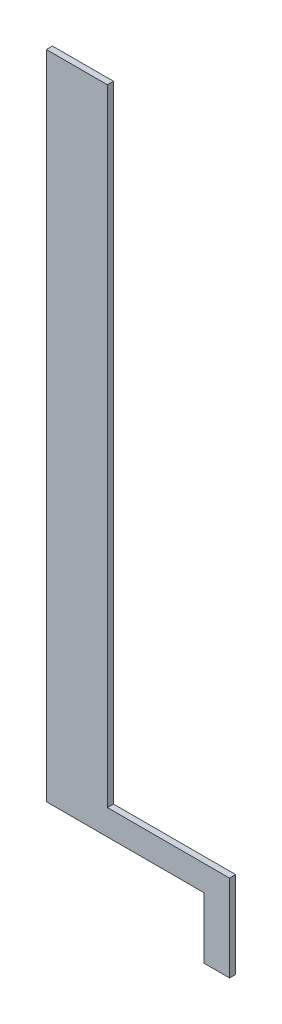
ISO-10303-21;
HEADER;
FILE_DESCRIPTION(('STEP AP214'),'2;1');
FILE_NAME('part.step','',(''),(''),'','','');
FILE_SCHEMA(('AUTOMOTIVE_DESIGN { 1 0 10303 214 1 1 1 1 }'));
ENDSEC;
DATA;
#1=APPLICATION_CONTEXT('core data for automotive mechanical design processes');
#2=APPLICATION_PROTOCOL_DEFINITION('international standard','automotive_design',2000,#1);
#3=PRODUCT_CONTEXT('',#1,'mechanical');
#4=PRODUCT('Part','Part','',(#3));
#5=PRODUCT_RELATED_PRODUCT_CATEGORY('part','',(#4));
#6=PRODUCT_DEFINITION_FORMATION('','',#4);
#7=PRODUCT_DEFINITION_CONTEXT('part definition',#1,'design');
#8=PRODUCT_DEFINITION('design','',#6,#7);
#9=PRODUCT_DEFINITION_SHAPE('','',#8);
#10=(LENGTH_UNIT() NAMED_UNIT(*) SI_UNIT(.MILLI.,.METRE.));
#11=(NAMED_UNIT(*) PLANE_ANGLE_UNIT() SI_UNIT($,.RADIAN.));
#12=(NAMED_UNIT(*) SI_UNIT($,.STERADIAN.) SOLID_ANGLE_UNIT());
#13=UNCERTAINTY_MEASURE_WITH_UNIT(LENGTH_MEASURE(1.E-05),#10,'distance_accuracy_value','');
#14=(GEOMETRIC_REPRESENTATION_CONTEXT(3) GLOBAL_UNCERTAINTY_ASSIGNED_CONTEXT((#13)) GLOBAL_UNIT_ASSIGNED_CONTEXT((#10,
#11,#12)) REPRESENTATION_CONTEXT('',''));
#15=CARTESIAN_POINT('',(0.,0.,0.));
#16=DIRECTION('',(0.,0.,1.));
#17=DIRECTION('',(1.,0.,0.));
#18=AXIS2_PLACEMENT_3D('',#15,#16,#17);
#19=CARTESIAN_POINT('',(62.5,-160.,1.5));
#20=DIRECTION('',(1.,0.,0.));
#21=DIRECTION('',(0.,1.,0.));
#22=AXIS2_PLACEMENT_3D('',#19,#20,#21);
#23=PLANE('',#22);
#24=DIRECTION('',(0.,-1.,0.));
#25=VECTOR('',#24,1.);
#26=CARTESIAN_POINT('',(62.5,-160.,-1.5));
#27=LINE('',#26,#25);
#28=CARTESIAN_POINT('',(62.5,-160.,-1.5));
#29=VERTEX_POINT('',#28);
#30=CARTESIAN_POINT('',(62.5,-190.,-1.5));
#31=VERTEX_POINT('',#30);
#32=EDGE_CURVE('E133',#29,#31,#27,.T.);
#33=ORIENTED_EDGE('',*,*,#32,.T.);
#34=DIRECTION('',(0.,0.,-1.));
#35=VECTOR('',#34,1.);
#36=CARTESIAN_POINT('',(62.5,-190.,1.5));
#37=LINE('',#36,#35);
#38=CARTESIAN_POINT('',(62.5,-190.,1.5));
#39=VERTEX_POINT('',#38);
#40=EDGE_CURVE('E41',#39,#31,#37,.T.);
#41=ORIENTED_EDGE('',*,*,#40,.F.);
#42=DIRECTION('',(0.,-1.,0.));
#43=VECTOR('',#42,1.);
#44=CARTESIAN_POINT('',(62.5,-160.,1.5));
#45=LINE('',#44,#43);
#46=CARTESIAN_POINT('',(62.5,-160.,1.5));
#47=VERTEX_POINT('',#46);
#48=EDGE_CURVE('E93',#47,#39,#45,.T.);
#49=ORIENTED_EDGE('',*,*,#48,.F.);
#50=DIRECTION('',(0.,0.,-1.));
#51=VECTOR('',#50,1.);
#52=CARTESIAN_POINT('',(62.5,-160.,1.5));
#53=LINE('',#52,#51);
#54=EDGE_CURVE('E11',#47,#29,#53,.T.);
#55=ORIENTED_EDGE('',*,*,#54,.T.);
#56=EDGE_LOOP('',(#33,#41,#49,#55));
#57=FACE_BOUND('',#56,.T.);
#58=ADVANCED_FACE('F33',(#57),#23,.F.);
#59=CARTESIAN_POINT('',(62.5,-190.,1.5));
#60=DIRECTION('',(0.,1.,0.));
#61=DIRECTION('',(0.,0.,1.));
#62=AXIS2_PLACEMENT_3D('',#59,#60,#61);
#63=PLANE('',#62);
#64=DIRECTION('',(1.,0.,0.));
#65=VECTOR('',#64,1.);
#66=CARTESIAN_POINT('',(62.5,-190.,-1.5));
#67=LINE('',#66,#65);
#68=CARTESIAN_POINT('',(75.,-190.,-1.5));
#69=VERTEX_POINT('',#68);
#70=EDGE_CURVE('E135',#31,#69,#67,.T.);
#71=ORIENTED_EDGE('',*,*,#70,.T.);
#72=DIRECTION('',(0.,0.,-1.));
#73=VECTOR('',#72,1.);
#74=CARTESIAN_POINT('',(75.,-190.,1.5));
#75=LINE('',#74,#73);
#76=CARTESIAN_POINT('',(75.,-190.,1.5));
#77=VERTEX_POINT('',#76);
#78=EDGE_CURVE('E154',#77,#69,#75,.T.);
#79=ORIENTED_EDGE('',*,*,#78,.F.);
#80=DIRECTION('',(1.,0.,0.));
#81=VECTOR('',#80,1.);
#82=CARTESIAN_POINT('',(62.5,-190.,1.5));
#83=LINE('',#82,#81);
#84=EDGE_CURVE('E162',#39,#77,#83,.T.);
#85=ORIENTED_EDGE('',*,*,#84,.F.);
#86=ORIENTED_EDGE('',*,*,#40,.T.);
#87=EDGE_LOOP('',(#71,#79,#85,#86));
#88=FACE_BOUND('',#87,.T.);
#89=ADVANCED_FACE('F160',(#88),#63,.F.);
#90=CARTESIAN_POINT('',(75.,-160.,1.5));
#91=DIRECTION('',(-1.,0.,0.));
#92=DIRECTION('',(0.,0.,1.));
#93=AXIS2_PLACEMENT_3D('',#90,#91,#92);
#94=PLANE('',#93);
#95=DIRECTION('',(0.,1.,0.));
#96=VECTOR('',#95,1.);
#97=CARTESIAN_POINT('',(75.,-160.,-1.5));
#98=LINE('',#97,#96);
#99=CARTESIAN_POINT('',(75.,-147.5,-1.5));
#100=VERTEX_POINT('',#99);
#101=EDGE_CURVE('E138',#69,#100,#98,.T.);
#102=ORIENTED_EDGE('',*,*,#101,.T.);
#103=DIRECTION('',(0.,0.,-1.));
#104=VECTOR('',#103,1.);
#105=CARTESIAN_POINT('',(75.,-147.5,1.5));
#106=LINE('',#105,#104);
#107=CARTESIAN_POINT('',(75.,-147.5,1.5));
#108=VERTEX_POINT('',#107);
#109=EDGE_CURVE('E151',#108,#100,#106,.T.);
#110=ORIENTED_EDGE('',*,*,#109,.F.);
#111=DIRECTION('',(0.,1.,0.));
#112=VECTOR('',#111,1.);
#113=CARTESIAN_POINT('',(75.,-160.,1.5));
#114=LINE('',#113,#112);
#115=EDGE_CURVE('E173',#77,#108,#114,.T.);
#116=ORIENTED_EDGE('',*,*,#115,.F.);
#117=ORIENTED_EDGE('',*,*,#78,.T.);
#118=EDGE_LOOP('',(#102,#110,#116,#117));
#119=FACE_BOUND('',#118,.T.);
#120=ADVANCED_FACE('F169',(#119),#94,.F.);
#121=CARTESIAN_POINT('',(15.,-147.5,1.5));
#122=DIRECTION('',(0.,-1.,0.));
#123=DIRECTION('',(0.,0.,-1.));
#124=AXIS2_PLACEMENT_3D('',#121,#122,#123);
#125=PLANE('',#124);
#126=DIRECTION('',(-1.,0.,0.));
#127=VECTOR('',#126,1.);
#128=CARTESIAN_POINT('',(15.,-147.5,-1.5));
#129=LINE('',#128,#127);
#130=CARTESIAN_POINT('',(15.,-147.5,-1.5));
#131=VERTEX_POINT('',#130);
#132=EDGE_CURVE('E141',#100,#131,#129,.T.);
#133=ORIENTED_EDGE('',*,*,#132,.T.);
#134=DIRECTION('',(0.,0.,-1.));
#135=VECTOR('',#134,1.);
#136=CARTESIAN_POINT('',(15.,-147.5,1.5));
#137=LINE('',#136,#135);
#138=CARTESIAN_POINT('',(15.,-147.5,1.5));
#139=VERTEX_POINT('',#138);
#140=EDGE_CURVE('E122',#139,#131,#137,.T.);
#141=ORIENTED_EDGE('',*,*,#140,.F.);
#142=DIRECTION('',(-1.,0.,0.));
#143=VECTOR('',#142,1.);
#144=CARTESIAN_POINT('',(65.,-147.5,1.5));
#145=LINE('',#144,#143);
#146=EDGE_CURVE('E113',#108,#139,#145,.T.);
#147=ORIENTED_EDGE('',*,*,#146,.F.);
#148=ORIENTED_EDGE('',*,*,#109,.T.);
#149=EDGE_LOOP('',(#133,#141,#147,#148));
#150=FACE_BOUND('',#149,.T.);
#151=ADVANCED_FACE('F172',(#150),#125,.F.);
#152=CARTESIAN_POINT('',(15.,160.,1.5));
#153=DIRECTION('',(-1.,0.,0.));
#154=DIRECTION('',(0.,-1.,0.));
#155=AXIS2_PLACEMENT_3D('',#152,#153,#154);
#156=PLANE('',#155);
#157=DIRECTION('',(0.,1.,0.));
#158=VECTOR('',#157,1.);
#159=CARTESIAN_POINT('',(15.,160.,-1.5));
#160=LINE('',#159,#158);
#161=CARTESIAN_POINT('',(15.,160.,-1.5));
#162=VERTEX_POINT('',#161);
#163=EDGE_CURVE('E121',#131,#162,#160,.T.);
#164=ORIENTED_EDGE('',*,*,#163,.T.);
#165=DIRECTION('',(0.,0.,-1.));
#166=VECTOR('',#165,1.);
#167=CARTESIAN_POINT('',(15.,160.,1.5));
#168=LINE('',#167,#166);
#169=CARTESIAN_POINT('',(15.,160.,1.5));
#170=VERTEX_POINT('',#169);
#171=EDGE_CURVE('E118',#170,#162,#168,.T.);
#172=ORIENTED_EDGE('',*,*,#171,.F.);
#173=DIRECTION('',(0.,1.,0.));
#174=VECTOR('',#173,1.);
#175=CARTESIAN_POINT('',(15.,160.,1.5));
#176=LINE('',#175,#174);
#177=EDGE_CURVE('E107',#139,#170,#176,.T.);
#178=ORIENTED_EDGE('',*,*,#177,.F.);
#179=ORIENTED_EDGE('',*,*,#140,.T.);
#180=EDGE_LOOP('',(#164,#172,#178,#179));
#181=FACE_BOUND('',#180,.T.);
#182=ADVANCED_FACE('F119',(#181),#156,.F.);
#183=CARTESIAN_POINT('',(-15.,160.,1.5));
#184=DIRECTION('',(0.,-1.,0.));
#185=DIRECTION('',(0.,0.,-1.));
#186=AXIS2_PLACEMENT_3D('',#183,#184,#185);
#187=PLANE('',#186);
#188=DIRECTION('',(-1.,0.,0.));
#189=VECTOR('',#188,1.);
#190=CARTESIAN_POINT('',(-15.,160.,-1.5));
#191=LINE('',#190,#189);
#192=CARTESIAN_POINT('',(-15.,160.,-1.5));
#193=VERTEX_POINT('',#192);
#194=EDGE_CURVE('E79',#162,#193,#191,.T.);
#195=ORIENTED_EDGE('',*,*,#194,.T.);
#196=DIRECTION('',(0.,0.,-1.));
#197=VECTOR('',#196,1.);
#198=CARTESIAN_POINT('',(-15.,160.,1.5));
#199=LINE('',#198,#197);
#200=CARTESIAN_POINT('',(-15.,160.,1.5));
#201=VERTEX_POINT('',#200);
#202=EDGE_CURVE('E123',#201,#193,#199,.T.);
#203=ORIENTED_EDGE('',*,*,#202,.F.);
#204=DIRECTION('',(-1.,0.,0.));
#205=VECTOR('',#204,1.);
#206=CARTESIAN_POINT('',(-15.,160.,1.5));
#207=LINE('',#206,#205);
#208=EDGE_CURVE('E111',#170,#201,#207,.T.);
#209=ORIENTED_EDGE('',*,*,#208,.F.);
#210=ORIENTED_EDGE('',*,*,#171,.T.);
#211=EDGE_LOOP('',(#195,#203,#209,#210));
#212=FACE_BOUND('',#211,.T.);
#213=ADVANCED_FACE('F125',(#212),#187,.F.);
#214=CARTESIAN_POINT('',(-15.,160.,1.5));
#215=DIRECTION('',(1.,0.,0.));
#216=DIRECTION('',(0.,1.,0.));
#217=AXIS2_PLACEMENT_3D('',#214,#215,#216);
#218=PLANE('',#217);
#219=DIRECTION('',(0.,-1.,0.));
#220=VECTOR('',#219,1.);
#221=CARTESIAN_POINT('',(-15.,160.,-1.5));
#222=LINE('',#221,#220);
#223=CARTESIAN_POINT('',(-15.,-160.,-1.5));
#224=VERTEX_POINT('',#223);
#225=EDGE_CURVE('E86',#193,#224,#222,.T.);
#226=ORIENTED_EDGE('',*,*,#225,.T.);
#227=DIRECTION('',(0.,0.,-1.));
#228=VECTOR('',#227,1.);
#229=CARTESIAN_POINT('',(-15.,-160.,1.5));
#230=LINE('',#229,#228);
#231=CARTESIAN_POINT('',(-15.,-160.,1.5));
#232=VERTEX_POINT('',#231);
#233=EDGE_CURVE('E129',#232,#224,#230,.T.);
#234=ORIENTED_EDGE('',*,*,#233,.F.);
#235=DIRECTION('',(0.,-1.,0.));
#236=VECTOR('',#235,1.);
#237=CARTESIAN_POINT('',(-15.,160.,1.5));
#238=LINE('',#237,#236);
#239=EDGE_CURVE('E127',#201,#232,#238,.T.);
#240=ORIENTED_EDGE('',*,*,#239,.F.);
#241=ORIENTED_EDGE('',*,*,#202,.T.);
#242=EDGE_LOOP('',(#226,#234,#240,#241));
#243=FACE_BOUND('',#242,.T.);
#244=ADVANCED_FACE('F194',(#243),#218,.F.);
#245=CARTESIAN_POINT('',(-15.,-160.,1.5));
#246=DIRECTION('',(0.,1.,0.));
#247=DIRECTION('',(0.,0.,1.));
#248=AXIS2_PLACEMENT_3D('',#245,#246,#247);
#249=PLANE('',#248);
#250=DIRECTION('',(1.,0.,0.));
#251=VECTOR('',#250,1.);
#252=CARTESIAN_POINT('',(-15.,-160.,-1.5));
#253=LINE('',#252,#251);
#254=EDGE_CURVE('E146',#224,#29,#253,.T.);
#255=ORIENTED_EDGE('',*,*,#254,.T.);
#256=ORIENTED_EDGE('',*,*,#54,.F.);
#257=DIRECTION('',(1.,0.,0.));
#258=VECTOR('',#257,1.);
#259=CARTESIAN_POINT('',(15.,-160.,1.5));
#260=LINE('',#259,#258);
#261=EDGE_CURVE('E49',#232,#47,#260,.T.);
#262=ORIENTED_EDGE('',*,*,#261,.F.);
#263=ORIENTED_EDGE('',*,*,#233,.T.);
#264=EDGE_LOOP('',(#255,#256,#262,#263));
#265=FACE_BOUND('',#264,.T.);
#266=ADVANCED_FACE('F178',(#265),#249,.F.);
#267=CARTESIAN_POINT('',(0.,0.,1.5));
#268=DIRECTION('',(0.,0.,-1.));
#269=DIRECTION('',(-1.,0.,0.));
#270=AXIS2_PLACEMENT_3D('',#267,#268,#269);
#271=PLANE('',#270);
#272=ORIENTED_EDGE('',*,*,#261,.T.);
#273=ORIENTED_EDGE('',*,*,#48,.T.);
#274=ORIENTED_EDGE('',*,*,#84,.T.);
#275=ORIENTED_EDGE('',*,*,#115,.T.);
#276=ORIENTED_EDGE('',*,*,#146,.T.);
#277=ORIENTED_EDGE('',*,*,#177,.T.);
#278=ORIENTED_EDGE('',*,*,#208,.T.);
#279=ORIENTED_EDGE('',*,*,#239,.T.);
#280=EDGE_LOOP('',(#272,#273,#274,#275,#276,#277,#278,#279));
#281=FACE_BOUND('',#280,.T.);
#282=ADVANCED_FACE('F109',(#281),#271,.F.);
#283=CARTESIAN_POINT('',(0.,0.,-1.5));
#284=DIRECTION('',(0.,0.,-1.));
#285=DIRECTION('',(-1.,0.,0.));
#286=AXIS2_PLACEMENT_3D('',#283,#284,#285);
#287=PLANE('',#286);
#288=ORIENTED_EDGE('',*,*,#32,.F.);
#289=ORIENTED_EDGE('',*,*,#254,.F.);
#290=ORIENTED_EDGE('',*,*,#225,.F.);
#291=ORIENTED_EDGE('',*,*,#194,.F.);
#292=ORIENTED_EDGE('',*,*,#163,.F.);
#293=ORIENTED_EDGE('',*,*,#132,.F.);
#294=ORIENTED_EDGE('',*,*,#101,.F.);
#295=ORIENTED_EDGE('',*,*,#70,.F.);
#296=EDGE_LOOP('',(#288,#289,#290,#291,#292,#293,#294,#295));
#297=FACE_BOUND('',#296,.T.);
#298=ADVANCED_FACE('F165',(#297),#287,.T.);
#299=CLOSED_SHELL('',(#58,#89,#120,#151,#182,#213,#244,#266,#282,#298));
#300=MANIFOLD_SOLID_BREP('B2',#299);
#301=ADVANCED_BREP_SHAPE_REPRESENTATION('',(#18,#300),#14);
#302=SHAPE_DEFINITION_REPRESENTATION(#9,#301);
ENDSEC;
END-ISO-10303-21;
